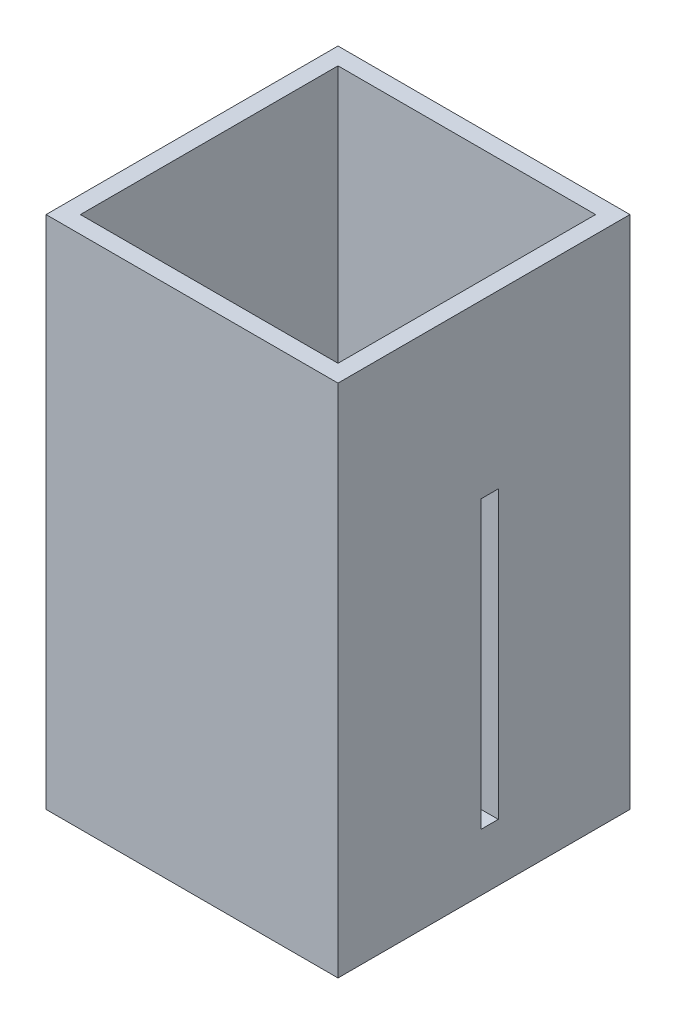
ISO-10303-21;
HEADER;
FILE_DESCRIPTION(('STEP AP214'),'2;1');
FILE_NAME('part.step','',(''),(''),'','','');
FILE_SCHEMA(('AUTOMOTIVE_DESIGN { 1 0 10303 214 1 1 1 1 }'));
ENDSEC;
DATA;
#1=APPLICATION_CONTEXT('core data for automotive mechanical design processes');
#2=APPLICATION_PROTOCOL_DEFINITION('international standard','automotive_design',2000,#1);
#3=PRODUCT_CONTEXT('',#1,'mechanical');
#4=PRODUCT('Part','Part','',(#3));
#5=PRODUCT_RELATED_PRODUCT_CATEGORY('part','',(#4));
#6=PRODUCT_DEFINITION_FORMATION('','',#4);
#7=PRODUCT_DEFINITION_CONTEXT('part definition',#1,'design');
#8=PRODUCT_DEFINITION('design','',#6,#7);
#9=PRODUCT_DEFINITION_SHAPE('','',#8);
#10=(LENGTH_UNIT() NAMED_UNIT(*) SI_UNIT(.MILLI.,.METRE.));
#11=(NAMED_UNIT(*) PLANE_ANGLE_UNIT() SI_UNIT($,.RADIAN.));
#12=(NAMED_UNIT(*) SI_UNIT($,.STERADIAN.) SOLID_ANGLE_UNIT());
#13=UNCERTAINTY_MEASURE_WITH_UNIT(LENGTH_MEASURE(1.E-05),#10,'distance_accuracy_value','');
#14=(GEOMETRIC_REPRESENTATION_CONTEXT(3) GLOBAL_UNCERTAINTY_ASSIGNED_CONTEXT((#13)) GLOBAL_UNIT_ASSIGNED_CONTEXT((#10,
#11,#12)) REPRESENTATION_CONTEXT('',''));
#15=CARTESIAN_POINT('',(0.,0.,0.));
#16=DIRECTION('',(0.,0.,1.));
#17=DIRECTION('',(1.,0.,0.));
#18=AXIS2_PLACEMENT_3D('',#15,#16,#17);
#19=CARTESIAN_POINT('',(0.,20.,2.5));
#20=DIRECTION('',(0.,-1.,0.));
#21=DIRECTION('',(0.,0.,-1.));
#22=AXIS2_PLACEMENT_3D('',#19,#20,#21);
#23=CYLINDRICAL_SURFACE('',#22,15.);
#24=CARTESIAN_POINT('',(0.,20.,2.5));
#25=DIRECTION('',(0.,-1.,0.));
#26=DIRECTION('',(0.,0.,-1.));
#27=AXIS2_PLACEMENT_3D('',#24,#25,#26);
#28=CIRCLE('',#27,15.);
#29=CARTESIAN_POINT('',(0.,20.,-12.5));
#30=VERTEX_POINT('',#29);
#31=EDGE_CURVE('E11',#30,#30,#28,.T.);
#32=ORIENTED_EDGE('',*,*,#31,.T.);
#33=EDGE_LOOP('',(#32));
#34=FACE_BOUND('',#33,.T.);
#35=CARTESIAN_POINT('',(0.,10.,2.5));
#36=DIRECTION('',(0.,-1.,0.));
#37=DIRECTION('',(0.,0.,-1.));
#38=AXIS2_PLACEMENT_3D('',#35,#36,#37);
#39=CIRCLE('',#38,15.);
#40=CARTESIAN_POINT('',(0.,10.,-12.5));
#41=VERTEX_POINT('',#40);
#42=EDGE_CURVE('E44',#41,#41,#39,.T.);
#43=ORIENTED_EDGE('',*,*,#42,.F.);
#44=EDGE_LOOP('',(#43));
#45=FACE_BOUND('',#44,.T.);
#46=ADVANCED_FACE('F41',(#34,#45),#23,.T.);
#47=CARTESIAN_POINT('',(0.,20.,2.5));
#48=DIRECTION('',(0.,-1.,0.));
#49=DIRECTION('',(0.,0.,-1.));
#50=AXIS2_PLACEMENT_3D('',#47,#48,#49);
#51=PLANE('',#50);
#52=ORIENTED_EDGE('',*,*,#31,.F.);
#53=EDGE_LOOP('',(#52));
#54=FACE_BOUND('',#53,.T.);
#55=ADVANCED_FACE('F56',(#54),#51,.F.);
#56=CARTESIAN_POINT('',(0.,10.,2.5));
#57=DIRECTION('',(0.,-1.,0.));
#58=DIRECTION('',(0.,0.,-1.));
#59=AXIS2_PLACEMENT_3D('',#56,#57,#58);
#60=PLANE('',#59);
#61=ORIENTED_EDGE('',*,*,#42,.T.);
#62=EDGE_LOOP('',(#61));
#63=FACE_BOUND('',#62,.T.);
#64=ADVANCED_FACE('F53',(#63),#60,.T.);
#65=CLOSED_SHELL('',(#46,#55,#64));
#66=MANIFOLD_SOLID_BREP('B2',#65);
#67=CARTESIAN_POINT('',(25.5,90.,-25.5));
#68=DIRECTION('',(-1.,0.,0.));
#69=DIRECTION('',(0.,0.,1.));
#70=AXIS2_PLACEMENT_3D('',#67,#68,#69);
#71=PLANE('',#70);
#72=DIRECTION('',(0.,0.,1.));
#73=VECTOR('',#72,1.);
#74=CARTESIAN_POINT('',(25.5,60.,-2.5));
#75=LINE('',#74,#73);
#76=CARTESIAN_POINT('',(25.5,60.,-2.5));
#77=VERTEX_POINT('',#76);
#78=CARTESIAN_POINT('',(25.5,60.,0.500000000000004));
#79=VERTEX_POINT('',#78);
#80=EDGE_CURVE('E211',#77,#79,#75,.T.);
#81=ORIENTED_EDGE('',*,*,#80,.F.);
#82=DIRECTION('',(0.,1.,0.));
#83=VECTOR('',#82,1.);
#84=CARTESIAN_POINT('',(25.5,10.,-2.5));
#85=LINE('',#84,#83);
#86=CARTESIAN_POINT('',(25.5,10.,-2.5));
#87=VERTEX_POINT('',#86);
#88=EDGE_CURVE('E96',#87,#77,#85,.T.);
#89=ORIENTED_EDGE('',*,*,#88,.F.);
#90=DIRECTION('',(0.,0.,-1.));
#91=VECTOR('',#90,1.);
#92=CARTESIAN_POINT('',(25.5,10.,-2.5));
#93=LINE('',#92,#91);
#94=CARTESIAN_POINT('',(25.5,10.,0.500000000000005));
#95=VERTEX_POINT('',#94);
#96=EDGE_CURVE('E218',#95,#87,#93,.T.);
#97=ORIENTED_EDGE('',*,*,#96,.F.);
#98=DIRECTION('',(0.,-1.,0.));
#99=VECTOR('',#98,1.);
#100=CARTESIAN_POINT('',(25.5,10.,0.500000000000005));
#101=LINE('',#100,#99);
#102=EDGE_CURVE('E201',#79,#95,#101,.T.);
#103=ORIENTED_EDGE('',*,*,#102,.F.);
#104=EDGE_LOOP('',(#81,#89,#97,#103));
#105=FACE_BOUND('',#104,.T.);
#106=DIRECTION('',(0.,0.,-1.));
#107=VECTOR('',#106,1.);
#108=CARTESIAN_POINT('',(25.5,0.,-25.5));
#109=LINE('',#108,#107);
#110=CARTESIAN_POINT('',(25.5,0.,25.5));
#111=VERTEX_POINT('',#110);
#112=CARTESIAN_POINT('',(25.5,0.,-25.5));
#113=VERTEX_POINT('',#112);
#114=EDGE_CURVE('E256',#111,#113,#109,.T.);
#115=ORIENTED_EDGE('',*,*,#114,.T.);
#116=DIRECTION('',(0.,-1.,0.));
#117=VECTOR('',#116,1.);
#118=CARTESIAN_POINT('',(25.5,90.,-25.5));
#119=LINE('',#118,#117);
#120=CARTESIAN_POINT('',(25.5,90.,-25.5));
#121=VERTEX_POINT('',#120);
#122=EDGE_CURVE('E306',#121,#113,#119,.T.);
#123=ORIENTED_EDGE('',*,*,#122,.F.);
#124=DIRECTION('',(0.,0.,-1.));
#125=VECTOR('',#124,1.);
#126=CARTESIAN_POINT('',(25.5,90.,-25.5));
#127=LINE('',#126,#125);
#128=CARTESIAN_POINT('',(25.5,90.,25.5));
#129=VERTEX_POINT('',#128);
#130=EDGE_CURVE('E280',#129,#121,#127,.T.);
#131=ORIENTED_EDGE('',*,*,#130,.F.);
#132=DIRECTION('',(0.,-1.,0.));
#133=VECTOR('',#132,1.);
#134=CARTESIAN_POINT('',(25.5,90.,25.5));
#135=LINE('',#134,#133);
#136=EDGE_CURVE('E290',#129,#111,#135,.T.);
#137=ORIENTED_EDGE('',*,*,#136,.T.);
#138=EDGE_LOOP('',(#115,#123,#131,#137));
#139=FACE_BOUND('',#138,.T.);
#140=ADVANCED_FACE('F82',(#105,#139),#71,.F.);
#141=CARTESIAN_POINT('',(-25.5,90.,-25.5));
#142=DIRECTION('',(0.,0.,1.));
#143=DIRECTION('',(1.,0.,0.));
#144=AXIS2_PLACEMENT_3D('',#141,#142,#143);
#145=PLANE('',#144);
#146=DIRECTION('',(-1.,0.,0.));
#147=VECTOR('',#146,1.);
#148=CARTESIAN_POINT('',(-25.5,0.,-25.5));
#149=LINE('',#148,#147);
#150=CARTESIAN_POINT('',(-25.5,0.,-25.5));
#151=VERTEX_POINT('',#150);
#152=EDGE_CURVE('E293',#113,#151,#149,.T.);
#153=ORIENTED_EDGE('',*,*,#152,.T.);
#154=DIRECTION('',(0.,-1.,0.));
#155=VECTOR('',#154,1.);
#156=CARTESIAN_POINT('',(-25.5,90.,-25.5));
#157=LINE('',#156,#155);
#158=CARTESIAN_POINT('',(-25.5,90.,-25.5));
#159=VERTEX_POINT('',#158);
#160=EDGE_CURVE('E303',#159,#151,#157,.T.);
#161=ORIENTED_EDGE('',*,*,#160,.F.);
#162=DIRECTION('',(-1.,0.,0.));
#163=VECTOR('',#162,1.);
#164=CARTESIAN_POINT('',(-25.5,90.,-25.5));
#165=LINE('',#164,#163);
#166=EDGE_CURVE('E283',#121,#159,#165,.T.);
#167=ORIENTED_EDGE('',*,*,#166,.F.);
#168=ORIENTED_EDGE('',*,*,#122,.T.);
#169=EDGE_LOOP('',(#153,#161,#167,#168));
#170=FACE_BOUND('',#169,.T.);
#171=ADVANCED_FACE('F334',(#170),#145,.F.);
#172=CARTESIAN_POINT('',(-25.5,90.,-25.5));
#173=DIRECTION('',(1.,0.,0.));
#174=DIRECTION('',(0.,0.,-1.));
#175=AXIS2_PLACEMENT_3D('',#172,#173,#174);
#176=PLANE('',#175);
#177=DIRECTION('',(0.,0.,-1.));
#178=VECTOR('',#177,1.);
#179=CARTESIAN_POINT('',(-25.5,10.,-2.5));
#180=LINE('',#179,#178);
#181=CARTESIAN_POINT('',(-25.5,10.,0.500000000000005));
#182=VERTEX_POINT('',#181);
#183=CARTESIAN_POINT('',(-25.5,10.,-2.5));
#184=VERTEX_POINT('',#183);
#185=EDGE_CURVE('E230',#182,#184,#180,.T.);
#186=ORIENTED_EDGE('',*,*,#185,.T.);
#187=DIRECTION('',(0.,1.,0.));
#188=VECTOR('',#187,1.);
#189=CARTESIAN_POINT('',(-25.5,10.,-2.5));
#190=LINE('',#189,#188);
#191=CARTESIAN_POINT('',(-25.5,60.,-2.5));
#192=VERTEX_POINT('',#191);
#193=EDGE_CURVE('E220',#184,#192,#190,.T.);
#194=ORIENTED_EDGE('',*,*,#193,.T.);
#195=DIRECTION('',(0.,0.,1.));
#196=VECTOR('',#195,1.);
#197=CARTESIAN_POINT('',(-25.5,60.,-2.5));
#198=LINE('',#197,#196);
#199=CARTESIAN_POINT('',(-25.5,60.,0.500000000000004));
#200=VERTEX_POINT('',#199);
#201=EDGE_CURVE('E226',#192,#200,#198,.T.);
#202=ORIENTED_EDGE('',*,*,#201,.T.);
#203=DIRECTION('',(0.,-1.,0.));
#204=VECTOR('',#203,1.);
#205=CARTESIAN_POINT('',(-25.5,10.,0.500000000000005));
#206=LINE('',#205,#204);
#207=EDGE_CURVE('E104',#200,#182,#206,.T.);
#208=ORIENTED_EDGE('',*,*,#207,.T.);
#209=EDGE_LOOP('',(#186,#194,#202,#208));
#210=FACE_BOUND('',#209,.T.);
#211=DIRECTION('',(0.,0.,1.));
#212=VECTOR('',#211,1.);
#213=CARTESIAN_POINT('',(-25.5,0.,-25.5));
#214=LINE('',#213,#212);
#215=CARTESIAN_POINT('',(-25.5,0.,25.5));
#216=VERTEX_POINT('',#215);
#217=EDGE_CURVE('E295',#151,#216,#214,.T.);
#218=ORIENTED_EDGE('',*,*,#217,.T.);
#219=DIRECTION('',(0.,-1.,0.));
#220=VECTOR('',#219,1.);
#221=CARTESIAN_POINT('',(-25.5,90.,25.5));
#222=LINE('',#221,#220);
#223=CARTESIAN_POINT('',(-25.5,90.,25.5));
#224=VERTEX_POINT('',#223);
#225=EDGE_CURVE('E300',#224,#216,#222,.T.);
#226=ORIENTED_EDGE('',*,*,#225,.F.);
#227=DIRECTION('',(0.,0.,1.));
#228=VECTOR('',#227,1.);
#229=CARTESIAN_POINT('',(-25.5,90.,-25.5));
#230=LINE('',#229,#228);
#231=EDGE_CURVE('E286',#159,#224,#230,.T.);
#232=ORIENTED_EDGE('',*,*,#231,.F.);
#233=ORIENTED_EDGE('',*,*,#160,.T.);
#234=EDGE_LOOP('',(#218,#226,#232,#233));
#235=FACE_BOUND('',#234,.T.);
#236=ADVANCED_FACE('F330',(#210,#235),#176,.F.);
#237=CARTESIAN_POINT('',(-25.5,90.,25.5));
#238=DIRECTION('',(0.,0.,-1.));
#239=DIRECTION('',(-1.,0.,0.));
#240=AXIS2_PLACEMENT_3D('',#237,#238,#239);
#241=PLANE('',#240);
#242=DIRECTION('',(1.,0.,0.));
#243=VECTOR('',#242,1.);
#244=CARTESIAN_POINT('',(-25.5,0.,25.5));
#245=LINE('',#244,#243);
#246=EDGE_CURVE('E284',#216,#111,#245,.T.);
#247=ORIENTED_EDGE('',*,*,#246,.T.);
#248=ORIENTED_EDGE('',*,*,#136,.F.);
#249=DIRECTION('',(1.,0.,0.));
#250=VECTOR('',#249,1.);
#251=CARTESIAN_POINT('',(-25.5,90.,25.5));
#252=LINE('',#251,#250);
#253=EDGE_CURVE('E288',#224,#129,#252,.T.);
#254=ORIENTED_EDGE('',*,*,#253,.F.);
#255=ORIENTED_EDGE('',*,*,#225,.T.);
#256=EDGE_LOOP('',(#247,#248,#254,#255));
#257=FACE_BOUND('',#256,.T.);
#258=ADVANCED_FACE('F333',(#257),#241,.F.);
#259=CARTESIAN_POINT('',(0.,90.,0.));
#260=DIRECTION('',(0.,1.,0.));
#261=DIRECTION('',(0.,0.,1.));
#262=AXIS2_PLACEMENT_3D('',#259,#260,#261);
#263=PLANE('',#262);
#264=DIRECTION('',(0.,0.,-1.));
#265=VECTOR('',#264,1.);
#266=CARTESIAN_POINT('',(22.5,90.,-25.5));
#267=LINE('',#266,#265);
#268=CARTESIAN_POINT('',(22.5,90.,22.5));
#269=VERTEX_POINT('',#268);
#270=CARTESIAN_POINT('',(22.5,90.,-22.5));
#271=VERTEX_POINT('',#270);
#272=EDGE_CURVE('E272',#269,#271,#267,.T.);
#273=ORIENTED_EDGE('',*,*,#272,.F.);
#274=DIRECTION('',(1.,0.,0.));
#275=VECTOR('',#274,1.);
#276=CARTESIAN_POINT('',(-25.5,90.,22.5));
#277=LINE('',#276,#275);
#278=CARTESIAN_POINT('',(-22.5,90.,22.5));
#279=VERTEX_POINT('',#278);
#280=EDGE_CURVE('E262',#279,#269,#277,.T.);
#281=ORIENTED_EDGE('',*,*,#280,.F.);
#282=DIRECTION('',(0.,0.,1.));
#283=VECTOR('',#282,1.);
#284=CARTESIAN_POINT('',(-22.5,90.,-25.5));
#285=LINE('',#284,#283);
#286=CARTESIAN_POINT('',(-22.5,90.,-22.5));
#287=VERTEX_POINT('',#286);
#288=EDGE_CURVE('E276',#287,#279,#285,.T.);
#289=ORIENTED_EDGE('',*,*,#288,.F.);
#290=DIRECTION('',(-1.,0.,0.));
#291=VECTOR('',#290,1.);
#292=CARTESIAN_POINT('',(-25.5,90.,-22.5));
#293=LINE('',#292,#291);
#294=EDGE_CURVE('E274',#271,#287,#293,.T.);
#295=ORIENTED_EDGE('',*,*,#294,.F.);
#296=EDGE_LOOP('',(#273,#281,#289,#295));
#297=FACE_BOUND('',#296,.T.);
#298=ORIENTED_EDGE('',*,*,#130,.T.);
#299=ORIENTED_EDGE('',*,*,#166,.T.);
#300=ORIENTED_EDGE('',*,*,#231,.T.);
#301=ORIENTED_EDGE('',*,*,#253,.T.);
#302=EDGE_LOOP('',(#298,#299,#300,#301));
#303=FACE_BOUND('',#302,.T.);
#304=ADVANCED_FACE('F350',(#297,#303),#263,.T.);
#305=CARTESIAN_POINT('',(0.,0.,0.));
#306=DIRECTION('',(0.,1.,0.));
#307=DIRECTION('',(0.,0.,1.));
#308=AXIS2_PLACEMENT_3D('',#305,#306,#307);
#309=PLANE('',#308);
#310=ORIENTED_EDGE('',*,*,#114,.F.);
#311=ORIENTED_EDGE('',*,*,#246,.F.);
#312=ORIENTED_EDGE('',*,*,#217,.F.);
#313=ORIENTED_EDGE('',*,*,#152,.F.);
#314=EDGE_LOOP('',(#310,#311,#312,#313));
#315=FACE_BOUND('',#314,.T.);
#316=ADVANCED_FACE('F346',(#315),#309,.F.);
#317=CARTESIAN_POINT('',(22.5,90.,-25.5));
#318=DIRECTION('',(-1.,0.,0.));
#319=DIRECTION('',(0.,0.,1.));
#320=AXIS2_PLACEMENT_3D('',#317,#318,#319);
#321=PLANE('',#320);
#322=DIRECTION('',(0.,-1.,0.));
#323=VECTOR('',#322,1.);
#324=CARTESIAN_POINT('',(22.5,90.,-2.5));
#325=LINE('',#324,#323);
#326=CARTESIAN_POINT('',(22.5,60.,-2.5));
#327=VERTEX_POINT('',#326);
#328=CARTESIAN_POINT('',(22.5,10.,-2.5));
#329=VERTEX_POINT('',#328);
#330=EDGE_CURVE('E247',#327,#329,#325,.T.);
#331=ORIENTED_EDGE('',*,*,#330,.F.);
#332=DIRECTION('',(0.,0.,-1.));
#333=VECTOR('',#332,1.);
#334=CARTESIAN_POINT('',(22.5,60.,-25.5));
#335=LINE('',#334,#333);
#336=CARTESIAN_POINT('',(22.5,60.,0.500000000000004));
#337=VERTEX_POINT('',#336);
#338=EDGE_CURVE('E236',#337,#327,#335,.T.);
#339=ORIENTED_EDGE('',*,*,#338,.F.);
#340=DIRECTION('',(0.,1.,0.));
#341=VECTOR('',#340,1.);
#342=CARTESIAN_POINT('',(22.5,90.,0.500000000000004));
#343=LINE('',#342,#341);
#344=CARTESIAN_POINT('',(22.5,10.,0.500000000000005));
#345=VERTEX_POINT('',#344);
#346=EDGE_CURVE('E204',#345,#337,#343,.T.);
#347=ORIENTED_EDGE('',*,*,#346,.F.);
#348=DIRECTION('',(0.,0.,1.));
#349=VECTOR('',#348,1.);
#350=CARTESIAN_POINT('',(22.5,10.,-25.5));
#351=LINE('',#350,#349);
#352=EDGE_CURVE('E245',#329,#345,#351,.T.);
#353=ORIENTED_EDGE('',*,*,#352,.F.);
#354=EDGE_LOOP('',(#331,#339,#347,#353));
#355=FACE_BOUND('',#354,.T.);
#356=DIRECTION('',(0.,0.,-1.));
#357=VECTOR('',#356,1.);
#358=CARTESIAN_POINT('',(22.5,3.,-25.5));
#359=LINE('',#358,#357);
#360=CARTESIAN_POINT('',(22.5,3.,22.5));
#361=VERTEX_POINT('',#360);
#362=CARTESIAN_POINT('',(22.5,3.,-22.5));
#363=VERTEX_POINT('',#362);
#364=EDGE_CURVE('E249',#361,#363,#359,.T.);
#365=ORIENTED_EDGE('',*,*,#364,.F.);
#366=DIRECTION('',(0.,-1.,0.));
#367=VECTOR('',#366,1.);
#368=CARTESIAN_POINT('',(22.5,90.,22.5));
#369=LINE('',#368,#367);
#370=EDGE_CURVE('E258',#269,#361,#369,.T.);
#371=ORIENTED_EDGE('',*,*,#370,.F.);
#372=ORIENTED_EDGE('',*,*,#272,.T.);
#373=DIRECTION('',(0.,-1.,0.));
#374=VECTOR('',#373,1.);
#375=CARTESIAN_POINT('',(22.5,90.,-22.5));
#376=LINE('',#375,#374);
#377=EDGE_CURVE('E253',#271,#363,#376,.T.);
#378=ORIENTED_EDGE('',*,*,#377,.T.);
#379=EDGE_LOOP('',(#365,#371,#372,#378));
#380=FACE_BOUND('',#379,.T.);
#381=ADVANCED_FACE('F361',(#355,#380),#321,.T.);
#382=CARTESIAN_POINT('',(-25.5,90.,-22.5));
#383=DIRECTION('',(0.,0.,1.));
#384=DIRECTION('',(1.,0.,0.));
#385=AXIS2_PLACEMENT_3D('',#382,#383,#384);
#386=PLANE('',#385);
#387=DIRECTION('',(-1.,0.,0.));
#388=VECTOR('',#387,1.);
#389=CARTESIAN_POINT('',(-25.5,3.,-22.5));
#390=LINE('',#389,#388);
#391=CARTESIAN_POINT('',(-22.5,3.,-22.5));
#392=VERTEX_POINT('',#391);
#393=EDGE_CURVE('E252',#363,#392,#390,.T.);
#394=ORIENTED_EDGE('',*,*,#393,.F.);
#395=ORIENTED_EDGE('',*,*,#377,.F.);
#396=ORIENTED_EDGE('',*,*,#294,.T.);
#397=DIRECTION('',(0.,-1.,0.));
#398=VECTOR('',#397,1.);
#399=CARTESIAN_POINT('',(-22.5,90.,-22.5));
#400=LINE('',#399,#398);
#401=EDGE_CURVE('E257',#287,#392,#400,.T.);
#402=ORIENTED_EDGE('',*,*,#401,.T.);
#403=EDGE_LOOP('',(#394,#395,#396,#402));
#404=FACE_BOUND('',#403,.T.);
#405=ADVANCED_FACE('F375',(#404),#386,.T.);
#406=CARTESIAN_POINT('',(-22.5,90.,-25.5));
#407=DIRECTION('',(1.,0.,0.));
#408=DIRECTION('',(0.,0.,-1.));
#409=AXIS2_PLACEMENT_3D('',#406,#407,#408);
#410=PLANE('',#409);
#411=DIRECTION('',(0.,1.,0.));
#412=VECTOR('',#411,1.);
#413=CARTESIAN_POINT('',(-22.5,90.,-2.5));
#414=LINE('',#413,#412);
#415=CARTESIAN_POINT('',(-22.5,10.,-2.5));
#416=VERTEX_POINT('',#415);
#417=CARTESIAN_POINT('',(-22.5,60.,-2.5));
#418=VERTEX_POINT('',#417);
#419=EDGE_CURVE('E39',#416,#418,#414,.T.);
#420=ORIENTED_EDGE('',*,*,#419,.F.);
#421=DIRECTION('',(0.,0.,-1.));
#422=VECTOR('',#421,1.);
#423=CARTESIAN_POINT('',(-22.5,10.,-25.5));
#424=LINE('',#423,#422);
#425=CARTESIAN_POINT('',(-22.5,10.,0.500000000000005));
#426=VERTEX_POINT('',#425);
#427=EDGE_CURVE('E89',#426,#416,#424,.T.);
#428=ORIENTED_EDGE('',*,*,#427,.F.);
#429=DIRECTION('',(0.,-1.,0.));
#430=VECTOR('',#429,1.);
#431=CARTESIAN_POINT('',(-22.5,90.,0.500000000000004));
#432=LINE('',#431,#430);
#433=CARTESIAN_POINT('',(-22.5,60.,0.500000000000004));
#434=VERTEX_POINT('',#433);
#435=EDGE_CURVE('E311',#434,#426,#432,.T.);
#436=ORIENTED_EDGE('',*,*,#435,.F.);
#437=DIRECTION('',(0.,0.,1.));
#438=VECTOR('',#437,1.);
#439=CARTESIAN_POINT('',(-22.5,60.,-25.5));
#440=LINE('',#439,#438);
#441=EDGE_CURVE('E309',#418,#434,#440,.T.);
#442=ORIENTED_EDGE('',*,*,#441,.F.);
#443=EDGE_LOOP('',(#420,#428,#436,#442));
#444=FACE_BOUND('',#443,.T.);
#445=DIRECTION('',(0.,0.,1.));
#446=VECTOR('',#445,1.);
#447=CARTESIAN_POINT('',(-22.5,3.,-25.5));
#448=LINE('',#447,#446);
#449=CARTESIAN_POINT('',(-22.5,3.,22.5));
#450=VERTEX_POINT('',#449);
#451=EDGE_CURVE('E264',#392,#450,#448,.T.);
#452=ORIENTED_EDGE('',*,*,#451,.F.);
#453=ORIENTED_EDGE('',*,*,#401,.F.);
#454=ORIENTED_EDGE('',*,*,#288,.T.);
#455=DIRECTION('',(0.,-1.,0.));
#456=VECTOR('',#455,1.);
#457=CARTESIAN_POINT('',(-22.5,90.,22.5));
#458=LINE('',#457,#456);
#459=EDGE_CURVE('E261',#279,#450,#458,.T.);
#460=ORIENTED_EDGE('',*,*,#459,.T.);
#461=EDGE_LOOP('',(#452,#453,#454,#460));
#462=FACE_BOUND('',#461,.T.);
#463=ADVANCED_FACE('F323',(#444,#462),#410,.T.);
#464=CARTESIAN_POINT('',(-25.5,90.,22.5));
#465=DIRECTION('',(0.,0.,-1.));
#466=DIRECTION('',(-1.,0.,0.));
#467=AXIS2_PLACEMENT_3D('',#464,#465,#466);
#468=PLANE('',#467);
#469=DIRECTION('',(1.,0.,0.));
#470=VECTOR('',#469,1.);
#471=CARTESIAN_POINT('',(-25.5,3.,22.5));
#472=LINE('',#471,#470);
#473=EDGE_CURVE('E268',#450,#361,#472,.T.);
#474=ORIENTED_EDGE('',*,*,#473,.F.);
#475=ORIENTED_EDGE('',*,*,#459,.F.);
#476=ORIENTED_EDGE('',*,*,#280,.T.);
#477=ORIENTED_EDGE('',*,*,#370,.T.);
#478=EDGE_LOOP('',(#474,#475,#476,#477));
#479=FACE_BOUND('',#478,.T.);
#480=ADVANCED_FACE('F368',(#479),#468,.T.);
#481=CARTESIAN_POINT('',(0.,3.,0.));
#482=DIRECTION('',(0.,1.,0.));
#483=DIRECTION('',(0.,0.,1.));
#484=AXIS2_PLACEMENT_3D('',#481,#482,#483);
#485=PLANE('',#484);
#486=ORIENTED_EDGE('',*,*,#364,.T.);
#487=ORIENTED_EDGE('',*,*,#393,.T.);
#488=ORIENTED_EDGE('',*,*,#451,.T.);
#489=ORIENTED_EDGE('',*,*,#473,.T.);
#490=EDGE_LOOP('',(#486,#487,#488,#489));
#491=FACE_BOUND('',#490,.T.);
#492=ADVANCED_FACE('F365',(#491),#485,.T.);
#493=CARTESIAN_POINT('',(-25.5,60.,-2.5));
#494=DIRECTION('',(0.,1.,0.));
#495=DIRECTION('',(0.,0.,1.));
#496=AXIS2_PLACEMENT_3D('',#493,#494,#495);
#497=PLANE('',#496);
#498=ORIENTED_EDGE('',*,*,#441,.T.);
#499=DIRECTION('',(1.,0.,0.));
#500=VECTOR('',#499,1.);
#501=CARTESIAN_POINT('',(-25.5,60.,0.500000000000004));
#502=LINE('',#501,#500);
#503=EDGE_CURVE('E207',#200,#434,#502,.T.);
#504=ORIENTED_EDGE('',*,*,#503,.F.);
#505=ORIENTED_EDGE('',*,*,#201,.F.);
#506=DIRECTION('',(1.,0.,0.));
#507=VECTOR('',#506,1.);
#508=CARTESIAN_POINT('',(-25.5,60.,-2.5));
#509=LINE('',#508,#507);
#510=EDGE_CURVE('E208',#192,#418,#509,.T.);
#511=ORIENTED_EDGE('',*,*,#510,.T.);
#512=EDGE_LOOP('',(#498,#504,#505,#511));
#513=FACE_BOUND('',#512,.T.);
#514=ADVANCED_FACE('F326',(#513),#497,.F.);
#515=CARTESIAN_POINT('',(-25.5,10.,0.500000000000005));
#516=DIRECTION('',(0.,0.,1.));
#517=DIRECTION('',(0.,-1.,0.));
#518=AXIS2_PLACEMENT_3D('',#515,#516,#517);
#519=PLANE('',#518);
#520=ORIENTED_EDGE('',*,*,#435,.T.);
#521=DIRECTION('',(1.,0.,0.));
#522=VECTOR('',#521,1.);
#523=CARTESIAN_POINT('',(-25.5,10.,0.500000000000005));
#524=LINE('',#523,#522);
#525=EDGE_CURVE('E238',#182,#426,#524,.T.);
#526=ORIENTED_EDGE('',*,*,#525,.F.);
#527=ORIENTED_EDGE('',*,*,#207,.F.);
#528=ORIENTED_EDGE('',*,*,#503,.T.);
#529=EDGE_LOOP('',(#520,#526,#527,#528));
#530=FACE_BOUND('',#529,.T.);
#531=ADVANCED_FACE('F328',(#530),#519,.F.);
#532=CARTESIAN_POINT('',(-25.5,10.,-2.5));
#533=DIRECTION('',(0.,-1.,0.));
#534=DIRECTION('',(0.,0.,-1.));
#535=AXIS2_PLACEMENT_3D('',#532,#533,#534);
#536=PLANE('',#535);
#537=ORIENTED_EDGE('',*,*,#427,.T.);
#538=DIRECTION('',(1.,0.,0.));
#539=VECTOR('',#538,1.);
#540=CARTESIAN_POINT('',(-25.5,10.,-2.5));
#541=LINE('',#540,#539);
#542=EDGE_CURVE('E233',#184,#416,#541,.T.);
#543=ORIENTED_EDGE('',*,*,#542,.F.);
#544=ORIENTED_EDGE('',*,*,#185,.F.);
#545=ORIENTED_EDGE('',*,*,#525,.T.);
#546=EDGE_LOOP('',(#537,#543,#544,#545));
#547=FACE_BOUND('',#546,.T.);
#548=ADVANCED_FACE('F314',(#547),#536,.F.);
#549=CARTESIAN_POINT('',(-25.5,10.,-2.5));
#550=DIRECTION('',(0.,0.,-1.));
#551=DIRECTION('',(0.,1.,0.));
#552=AXIS2_PLACEMENT_3D('',#549,#550,#551);
#553=PLANE('',#552);
#554=ORIENTED_EDGE('',*,*,#419,.T.);
#555=ORIENTED_EDGE('',*,*,#510,.F.);
#556=ORIENTED_EDGE('',*,*,#193,.F.);
#557=ORIENTED_EDGE('',*,*,#542,.T.);
#558=EDGE_LOOP('',(#554,#555,#556,#557));
#559=FACE_BOUND('',#558,.T.);
#560=ADVANCED_FACE('F321',(#559),#553,.F.);
#561=ORIENTED_EDGE('',*,*,#330,.T.);
#562=EDGE_CURVE('E237',#329,#87,#541,.T.);
#563=ORIENTED_EDGE('',*,*,#562,.T.);
#564=ORIENTED_EDGE('',*,*,#88,.T.);
#565=EDGE_CURVE('E213',#327,#77,#509,.T.);
#566=ORIENTED_EDGE('',*,*,#565,.F.);
#567=EDGE_LOOP('',(#561,#563,#564,#566));
#568=FACE_BOUND('',#567,.T.);
#569=ADVANCED_FACE('F384',(#568),#553,.F.);
#570=ORIENTED_EDGE('',*,*,#352,.T.);
#571=EDGE_CURVE('E240',#345,#95,#524,.T.);
#572=ORIENTED_EDGE('',*,*,#571,.T.);
#573=ORIENTED_EDGE('',*,*,#96,.T.);
#574=ORIENTED_EDGE('',*,*,#562,.F.);
#575=EDGE_LOOP('',(#570,#572,#573,#574));
#576=FACE_BOUND('',#575,.T.);
#577=ADVANCED_FACE('F390',(#576),#536,.F.);
#578=ORIENTED_EDGE('',*,*,#346,.T.);
#579=EDGE_CURVE('E196',#337,#79,#502,.T.);
#580=ORIENTED_EDGE('',*,*,#579,.T.);
#581=ORIENTED_EDGE('',*,*,#102,.T.);
#582=ORIENTED_EDGE('',*,*,#571,.F.);
#583=EDGE_LOOP('',(#578,#580,#581,#582));
#584=FACE_BOUND('',#583,.T.);
#585=ADVANCED_FACE('F198',(#584),#519,.F.);
#586=ORIENTED_EDGE('',*,*,#338,.T.);
#587=ORIENTED_EDGE('',*,*,#565,.T.);
#588=ORIENTED_EDGE('',*,*,#80,.T.);
#589=ORIENTED_EDGE('',*,*,#579,.F.);
#590=EDGE_LOOP('',(#586,#587,#588,#589));
#591=FACE_BOUND('',#590,.T.);
#592=ADVANCED_FACE('F212',(#591),#497,.F.);
#593=CLOSED_SHELL('',(#140,#171,#236,#258,#304,#316,#381,#405,#463,#480,#492,#514,#531,#548,
#560,#569,#577,#585,#592));
#594=MANIFOLD_SOLID_BREP('B6',#593);
#595=ADVANCED_BREP_SHAPE_REPRESENTATION('',(#18,#66,#594),#14);
#596=SHAPE_DEFINITION_REPRESENTATION(#9,#595);
ENDSEC;
END-ISO-10303-21;
